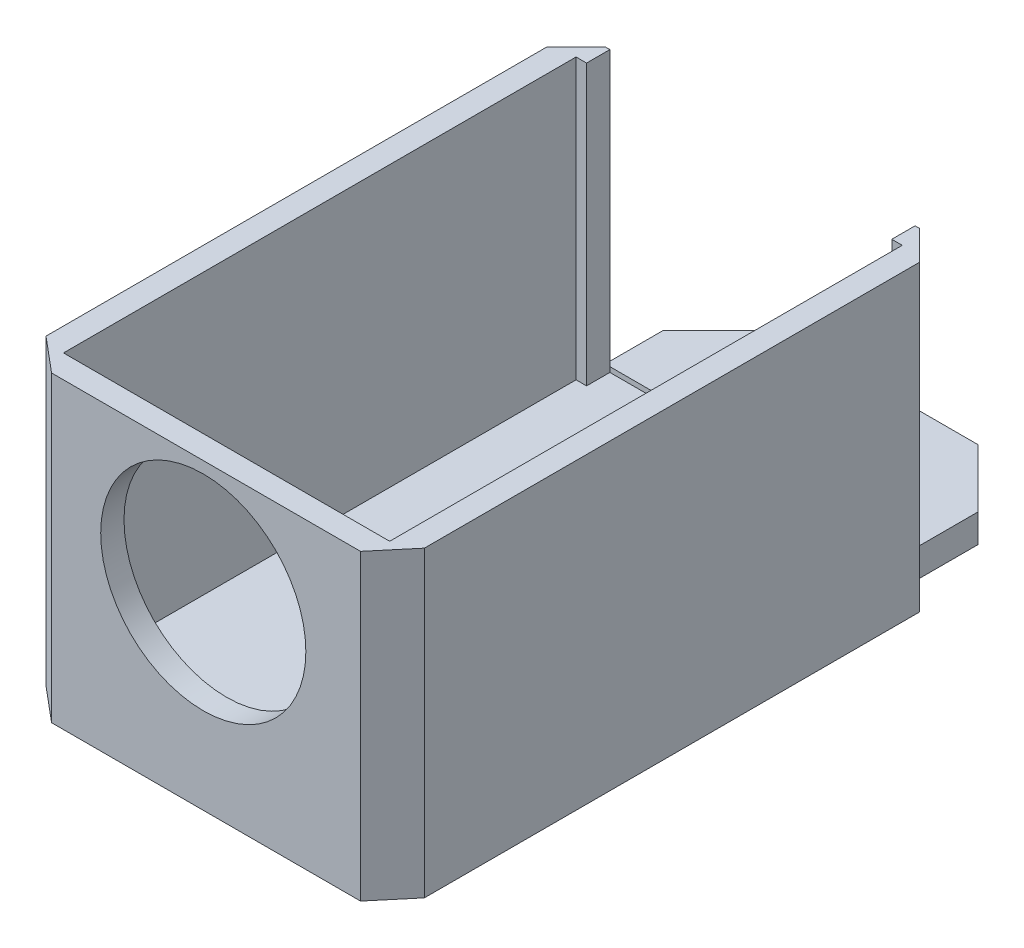
ISO-10303-21;
HEADER;
FILE_DESCRIPTION(('STEP AP214'),'2;1');
FILE_NAME('part.step','',(''),(''),'','','');
FILE_SCHEMA(('AUTOMOTIVE_DESIGN { 1 0 10303 214 1 1 1 1 }'));
ENDSEC;
DATA;
#1=APPLICATION_CONTEXT('core data for automotive mechanical design processes');
#2=APPLICATION_PROTOCOL_DEFINITION('international standard','automotive_design',2000,#1);
#3=PRODUCT_CONTEXT('',#1,'mechanical');
#4=PRODUCT('Part','Part','',(#3));
#5=PRODUCT_RELATED_PRODUCT_CATEGORY('part','',(#4));
#6=PRODUCT_DEFINITION_FORMATION('','',#4);
#7=PRODUCT_DEFINITION_CONTEXT('part definition',#1,'design');
#8=PRODUCT_DEFINITION('design','',#6,#7);
#9=PRODUCT_DEFINITION_SHAPE('','',#8);
#10=(LENGTH_UNIT() NAMED_UNIT(*) SI_UNIT(.MILLI.,.METRE.));
#11=(NAMED_UNIT(*) PLANE_ANGLE_UNIT() SI_UNIT($,.RADIAN.));
#12=(NAMED_UNIT(*) SI_UNIT($,.STERADIAN.) SOLID_ANGLE_UNIT());
#13=UNCERTAINTY_MEASURE_WITH_UNIT(LENGTH_MEASURE(1.E-05),#10,'distance_accuracy_value','');
#14=(GEOMETRIC_REPRESENTATION_CONTEXT(3) GLOBAL_UNCERTAINTY_ASSIGNED_CONTEXT((#13)) GLOBAL_UNIT_ASSIGNED_CONTEXT((#10,
#11,#12)) REPRESENTATION_CONTEXT('',''));
#15=CARTESIAN_POINT('',(0.,0.,0.));
#16=DIRECTION('',(0.,0.,1.));
#17=DIRECTION('',(1.,0.,0.));
#18=AXIS2_PLACEMENT_3D('',#15,#16,#17);
#19=CARTESIAN_POINT('',(-16.,26.,-24.));
#20=DIRECTION('',(0.,0.,1.));
#21=DIRECTION('',(1.,0.,0.));
#22=AXIS2_PLACEMENT_3D('',#19,#20,#21);
#23=PLANE('',#22);
#24=DIRECTION('',(1.,0.,0.));
#25=VECTOR('',#24,1.);
#26=CARTESIAN_POINT('',(-13.5,2.43238929317332,-24.));
#27=LINE('',#26,#25);
#28=CARTESIAN_POINT('',(-13.5,2.43238929317332,-24.));
#29=VERTEX_POINT('',#28);
#30=CARTESIAN_POINT('',(-13.1,2.43238929317332,-24.));
#31=VERTEX_POINT('',#30);
#32=EDGE_CURVE('E228',#29,#31,#27,.T.);
#33=ORIENTED_EDGE('',*,*,#32,.F.);
#34=DIRECTION('',(0.,1.,0.));
#35=VECTOR('',#34,1.);
#36=CARTESIAN_POINT('',(-13.5,26.,-24.));
#37=LINE('',#36,#35);
#38=CARTESIAN_POINT('',(-13.5,26.,-24.));
#39=VERTEX_POINT('',#38);
#40=EDGE_CURVE('E211',#29,#39,#37,.T.);
#41=ORIENTED_EDGE('',*,*,#40,.T.);
#42=DIRECTION('',(-1.,0.,0.));
#43=VECTOR('',#42,1.);
#44=CARTESIAN_POINT('',(-16.,26.,-24.));
#45=LINE('',#44,#43);
#46=CARTESIAN_POINT('',(-13.1,26.,-24.));
#47=VERTEX_POINT('',#46);
#48=EDGE_CURVE('E289',#47,#39,#45,.T.);
#49=ORIENTED_EDGE('',*,*,#48,.F.);
#50=DIRECTION('',(0.,1.,0.));
#51=VECTOR('',#50,1.);
#52=CARTESIAN_POINT('',(-13.1,2.,-24.));
#53=LINE('',#52,#51);
#54=EDGE_CURVE('E511',#31,#47,#53,.T.);
#55=ORIENTED_EDGE('',*,*,#54,.F.);
#56=EDGE_LOOP('',(#33,#41,#49,#55));
#57=FACE_BOUND('',#56,.T.);
#58=ADVANCED_FACE('F37',(#57),#23,.F.);
#59=CARTESIAN_POINT('',(13.1,2.43238929317332,-24.));
#60=VERTEX_POINT('',#59);
#61=CARTESIAN_POINT('',(13.5,2.43238929317332,-24.));
#62=VERTEX_POINT('',#61);
#63=EDGE_CURVE('E206',#60,#62,#27,.T.);
#64=ORIENTED_EDGE('',*,*,#63,.F.);
#65=DIRECTION('',(0.,-1.,0.));
#66=VECTOR('',#65,1.);
#67=CARTESIAN_POINT('',(13.1,2.,-24.));
#68=LINE('',#67,#66);
#69=CARTESIAN_POINT('',(13.1,26.,-24.));
#70=VERTEX_POINT('',#69);
#71=EDGE_CURVE('E462',#70,#60,#68,.T.);
#72=ORIENTED_EDGE('',*,*,#71,.F.);
#73=CARTESIAN_POINT('',(13.5,26.,-24.));
#74=VERTEX_POINT('',#73);
#75=EDGE_CURVE('E208',#74,#70,#45,.T.);
#76=ORIENTED_EDGE('',*,*,#75,.F.);
#77=DIRECTION('',(0.,-1.,0.));
#78=VECTOR('',#77,1.);
#79=CARTESIAN_POINT('',(13.5,26.,-24.));
#80=LINE('',#79,#78);
#81=EDGE_CURVE('E203',#74,#62,#80,.T.);
#82=ORIENTED_EDGE('',*,*,#81,.T.);
#83=EDGE_LOOP('',(#64,#72,#76,#82));
#84=FACE_BOUND('',#83,.T.);
#85=ADVANCED_FACE('F204',(#84),#23,.F.);
#86=CARTESIAN_POINT('',(-16.,26.,-22.));
#87=DIRECTION('',(0.,0.,1.));
#88=DIRECTION('',(1.,0.,0.));
#89=AXIS2_PLACEMENT_3D('',#86,#87,#88);
#90=PLANE('',#89);
#91=DIRECTION('',(0.,-1.,0.));
#92=VECTOR('',#91,1.);
#93=CARTESIAN_POINT('',(-13.1,26.,-22.));
#94=LINE('',#93,#92);
#95=CARTESIAN_POINT('',(-13.1,26.,-22.));
#96=VERTEX_POINT('',#95);
#97=CARTESIAN_POINT('',(-13.1,2.,-22.));
#98=VERTEX_POINT('',#97);
#99=EDGE_CURVE('E485',#96,#98,#94,.T.);
#100=ORIENTED_EDGE('',*,*,#99,.F.);
#101=DIRECTION('',(-1.,0.,0.));
#102=VECTOR('',#101,1.);
#103=CARTESIAN_POINT('',(-16.,26.,-22.));
#104=LINE('',#103,#102);
#105=CARTESIAN_POINT('',(-14.,26.,-22.));
#106=VERTEX_POINT('',#105);
#107=EDGE_CURVE('E273',#96,#106,#104,.T.);
#108=ORIENTED_EDGE('',*,*,#107,.T.);
#109=DIRECTION('',(0.,-1.,0.));
#110=VECTOR('',#109,1.);
#111=CARTESIAN_POINT('',(-14.,26.,-22.));
#112=LINE('',#111,#110);
#113=CARTESIAN_POINT('',(-14.,2.,-22.));
#114=VERTEX_POINT('',#113);
#115=EDGE_CURVE('E492',#106,#114,#112,.T.);
#116=ORIENTED_EDGE('',*,*,#115,.T.);
#117=DIRECTION('',(-1.,0.,0.));
#118=VECTOR('',#117,1.);
#119=CARTESIAN_POINT('',(-16.,2.,-22.));
#120=LINE('',#119,#118);
#121=EDGE_CURVE('E489',#98,#114,#120,.T.);
#122=ORIENTED_EDGE('',*,*,#121,.F.);
#123=EDGE_LOOP('',(#100,#108,#116,#122));
#124=FACE_BOUND('',#123,.T.);
#125=ADVANCED_FACE('F365',(#124),#90,.T.);
#126=CARTESIAN_POINT('',(16.,26.,-24.));
#127=DIRECTION('',(-1.,0.,0.));
#128=DIRECTION('',(0.,0.,1.));
#129=AXIS2_PLACEMENT_3D('',#126,#127,#128);
#130=PLANE('',#129);
#131=DIRECTION('',(0.,0.,-1.));
#132=VECTOR('',#131,1.);
#133=CARTESIAN_POINT('',(16.,0.,-24.));
#134=LINE('',#133,#132);
#135=CARTESIAN_POINT('',(16.,0.,21.0206160185145));
#136=VERTEX_POINT('',#135);
#137=CARTESIAN_POINT('',(16.,0.,-21.5));
#138=VERTEX_POINT('',#137);
#139=EDGE_CURVE('E298',#136,#138,#134,.T.);
#140=ORIENTED_EDGE('',*,*,#139,.T.);
#141=DIRECTION('',(0.,1.,0.));
#142=VECTOR('',#141,1.);
#143=CARTESIAN_POINT('',(16.,26.,-21.5));
#144=LINE('',#143,#142);
#145=CARTESIAN_POINT('',(16.,26.,-21.5));
#146=VERTEX_POINT('',#145);
#147=EDGE_CURVE('E226',#138,#146,#144,.T.);
#148=ORIENTED_EDGE('',*,*,#147,.T.);
#149=DIRECTION('',(0.,0.,-1.));
#150=VECTOR('',#149,1.);
#151=CARTESIAN_POINT('',(16.,26.,-24.));
#152=LINE('',#151,#150);
#153=CARTESIAN_POINT('',(16.,26.,21.0206160185145));
#154=VERTEX_POINT('',#153);
#155=EDGE_CURVE('E286',#154,#146,#152,.T.);
#156=ORIENTED_EDGE('',*,*,#155,.F.);
#157=DIRECTION('',(0.,-1.,0.));
#158=VECTOR('',#157,1.);
#159=CARTESIAN_POINT('',(16.,26.,21.0206160185145));
#160=LINE('',#159,#158);
#161=EDGE_CURVE('E297',#154,#136,#160,.T.);
#162=ORIENTED_EDGE('',*,*,#161,.T.);
#163=EDGE_LOOP('',(#140,#148,#156,#162));
#164=FACE_BOUND('',#163,.T.);
#165=ADVANCED_FACE('F370',(#164),#130,.F.);
#166=CARTESIAN_POINT('',(-16.,26.,-24.));
#167=DIRECTION('',(1.,0.,0.));
#168=DIRECTION('',(0.,0.,-1.));
#169=AXIS2_PLACEMENT_3D('',#166,#167,#168);
#170=PLANE('',#169);
#171=DIRECTION('',(0.,0.,1.));
#172=VECTOR('',#171,1.);
#173=CARTESIAN_POINT('',(-16.,26.,-24.));
#174=LINE('',#173,#172);
#175=CARTESIAN_POINT('',(-16.,26.,-21.5));
#176=VERTEX_POINT('',#175);
#177=CARTESIAN_POINT('',(-16.,26.,21.5));
#178=VERTEX_POINT('',#177);
#179=EDGE_CURVE('E292',#176,#178,#174,.T.);
#180=ORIENTED_EDGE('',*,*,#179,.F.);
#181=DIRECTION('',(0.,-1.,0.));
#182=VECTOR('',#181,1.);
#183=CARTESIAN_POINT('',(-16.,26.,-21.5));
#184=LINE('',#183,#182);
#185=CARTESIAN_POINT('',(-16.,0.,-21.5));
#186=VERTEX_POINT('',#185);
#187=EDGE_CURVE('E325',#176,#186,#184,.T.);
#188=ORIENTED_EDGE('',*,*,#187,.T.);
#189=DIRECTION('',(0.,0.,1.));
#190=VECTOR('',#189,1.);
#191=CARTESIAN_POINT('',(-16.,0.,-24.));
#192=LINE('',#191,#190);
#193=CARTESIAN_POINT('',(-16.,0.,21.5));
#194=VERTEX_POINT('',#193);
#195=EDGE_CURVE('E301',#186,#194,#192,.T.);
#196=ORIENTED_EDGE('',*,*,#195,.T.);
#197=DIRECTION('',(0.,1.,0.));
#198=VECTOR('',#197,1.);
#199=CARTESIAN_POINT('',(-16.,26.,21.5));
#200=LINE('',#199,#198);
#201=EDGE_CURVE('E322',#194,#178,#200,.T.);
#202=ORIENTED_EDGE('',*,*,#201,.T.);
#203=EDGE_LOOP('',(#180,#188,#196,#202));
#204=FACE_BOUND('',#203,.T.);
#205=ADVANCED_FACE('F368',(#204),#170,.F.);
#206=CARTESIAN_POINT('',(-16.,26.,24.));
#207=DIRECTION('',(0.,0.,-1.));
#208=DIRECTION('',(-1.,0.,0.));
#209=AXIS2_PLACEMENT_3D('',#206,#207,#208);
#210=PLANE('',#209);
#211=CARTESIAN_POINT('',(0.,16.205,24.));
#212=DIRECTION('',(0.,0.,1.));
#213=DIRECTION('',(1.,0.,0.));
#214=AXIS2_PLACEMENT_3D('',#211,#212,#213);
#215=CIRCLE('',#214,8.805);
#216=CARTESIAN_POINT('',(8.805,16.205,24.));
#217=VERTEX_POINT('',#216);
#218=EDGE_CURVE('E244',#217,#217,#215,.T.);
#219=ORIENTED_EDGE('',*,*,#218,.F.);
#220=EDGE_LOOP('',(#219));
#221=FACE_BOUND('',#220,.T.);
#222=DIRECTION('',(1.,0.,0.));
#223=VECTOR('',#222,1.);
#224=CARTESIAN_POINT('',(-16.,0.,24.));
#225=LINE('',#224,#223);
#226=CARTESIAN_POINT('',(-13.0206160185145,0.,24.));
#227=VERTEX_POINT('',#226);
#228=CARTESIAN_POINT('',(13.5,0.,24.));
#229=VERTEX_POINT('',#228);
#230=EDGE_CURVE('E290',#227,#229,#225,.T.);
#231=ORIENTED_EDGE('',*,*,#230,.T.);
#232=DIRECTION('',(0.,1.,0.));
#233=VECTOR('',#232,1.);
#234=CARTESIAN_POINT('',(13.5,26.,24.));
#235=LINE('',#234,#233);
#236=CARTESIAN_POINT('',(13.5,26.,24.));
#237=VERTEX_POINT('',#236);
#238=EDGE_CURVE('E316',#229,#237,#235,.T.);
#239=ORIENTED_EDGE('',*,*,#238,.T.);
#240=DIRECTION('',(1.,0.,0.));
#241=VECTOR('',#240,1.);
#242=CARTESIAN_POINT('',(-16.,26.,24.));
#243=LINE('',#242,#241);
#244=CARTESIAN_POINT('',(-13.0206160185145,26.,24.));
#245=VERTEX_POINT('',#244);
#246=EDGE_CURVE('E294',#245,#237,#243,.T.);
#247=ORIENTED_EDGE('',*,*,#246,.F.);
#248=DIRECTION('',(0.,-1.,0.));
#249=VECTOR('',#248,1.);
#250=CARTESIAN_POINT('',(-13.0206160185145,26.,24.));
#251=LINE('',#250,#249);
#252=EDGE_CURVE('E313',#245,#227,#251,.T.);
#253=ORIENTED_EDGE('',*,*,#252,.T.);
#254=EDGE_LOOP('',(#231,#239,#247,#253));
#255=FACE_BOUND('',#254,.T.);
#256=ADVANCED_FACE('F439',(#221,#255),#210,.F.);
#257=CARTESIAN_POINT('',(0.,26.,0.));
#258=DIRECTION('',(0.,1.,0.));
#259=DIRECTION('',(0.,0.,1.));
#260=AXIS2_PLACEMENT_3D('',#257,#258,#259);
#261=PLANE('',#260);
#262=ORIENTED_EDGE('',*,*,#48,.T.);
#263=DIRECTION('',(0.707106781186549,0.,-0.707106781186546));
#264=VECTOR('',#263,1.);
#265=CARTESIAN_POINT('',(-18.75,26.,-18.7500000000001));
#266=LINE('',#265,#264);
#267=EDGE_CURVE('E232',#39,#176,#266,.F.);
#268=ORIENTED_EDGE('',*,*,#267,.T.);
#269=ORIENTED_EDGE('',*,*,#179,.T.);
#270=DIRECTION('',(-0.766044443118976,0.,-0.642787609686542));
#271=VECTOR('',#270,1.);
#272=CARTESIAN_POINT('',(-17.1974979235459,26.,20.4951799340171));
#273=LINE('',#272,#271);
#274=EDGE_CURVE('E318',#178,#245,#273,.F.);
#275=ORIENTED_EDGE('',*,*,#274,.T.);
#276=ORIENTED_EDGE('',*,*,#246,.T.);
#277=DIRECTION('',(-0.64278760968654,0.,0.766044443118978));
#278=VECTOR('',#277,1.);
#279=CARTESIAN_POINT('',(19.7398182353983,26.,16.5636742008292));
#280=LINE('',#279,#278);
#281=EDGE_CURVE('E320',#237,#154,#280,.F.);
#282=ORIENTED_EDGE('',*,*,#281,.T.);
#283=ORIENTED_EDGE('',*,*,#155,.T.);
#284=DIRECTION('',(0.707106781186547,0.,0.707106781186549));
#285=VECTOR('',#284,1.);
#286=CARTESIAN_POINT('',(18.75,26.,-18.75));
#287=LINE('',#286,#285);
#288=EDGE_CURVE('E334',#146,#74,#287,.F.);
#289=ORIENTED_EDGE('',*,*,#288,.T.);
#290=ORIENTED_EDGE('',*,*,#75,.T.);
#291=DIRECTION('',(0.,0.,-1.));
#292=VECTOR('',#291,1.);
#293=CARTESIAN_POINT('',(13.1,26.,-4.));
#294=LINE('',#293,#292);
#295=CARTESIAN_POINT('',(13.1,26.,-22.));
#296=VERTEX_POINT('',#295);
#297=EDGE_CURVE('E461',#296,#70,#294,.T.);
#298=ORIENTED_EDGE('',*,*,#297,.F.);
#299=CARTESIAN_POINT('',(14.,26.,-22.));
#300=VERTEX_POINT('',#299);
#301=EDGE_CURVE('E279',#300,#296,#104,.T.);
#302=ORIENTED_EDGE('',*,*,#301,.F.);
#303=DIRECTION('',(0.,0.,-1.));
#304=VECTOR('',#303,1.);
#305=CARTESIAN_POINT('',(14.,26.,-24.));
#306=LINE('',#305,#304);
#307=CARTESIAN_POINT('',(14.,26.,22.));
#308=VERTEX_POINT('',#307);
#309=EDGE_CURVE('E270',#308,#300,#306,.T.);
#310=ORIENTED_EDGE('',*,*,#309,.F.);
#311=DIRECTION('',(1.,0.,0.));
#312=VECTOR('',#311,1.);
#313=CARTESIAN_POINT('',(-16.,26.,22.));
#314=LINE('',#313,#312);
#315=CARTESIAN_POINT('',(-14.,26.,22.));
#316=VERTEX_POINT('',#315);
#317=EDGE_CURVE('E284',#316,#308,#314,.T.);
#318=ORIENTED_EDGE('',*,*,#317,.F.);
#319=DIRECTION('',(0.,0.,1.));
#320=VECTOR('',#319,1.);
#321=CARTESIAN_POINT('',(-14.,26.,-24.));
#322=LINE('',#321,#320);
#323=EDGE_CURVE('E282',#106,#316,#322,.T.);
#324=ORIENTED_EDGE('',*,*,#323,.F.);
#325=ORIENTED_EDGE('',*,*,#107,.F.);
#326=DIRECTION('',(0.,0.,-1.));
#327=VECTOR('',#326,1.);
#328=CARTESIAN_POINT('',(-13.1,26.,-4.));
#329=LINE('',#328,#327);
#330=EDGE_CURVE('E467',#96,#47,#329,.T.);
#331=ORIENTED_EDGE('',*,*,#330,.T.);
#332=EDGE_LOOP('',(#262,#268,#269,#275,#276,#282,#283,#289,#290,#298,#302,#310,#318,#324,#325,#331));
#333=FACE_BOUND('',#332,.T.);
#334=ADVANCED_FACE('F436',(#333),#261,.T.);
#335=CARTESIAN_POINT('',(0.,0.,0.));
#336=DIRECTION('',(0.,1.,0.));
#337=DIRECTION('',(0.,0.,1.));
#338=AXIS2_PLACEMENT_3D('',#335,#336,#337);
#339=PLANE('',#338);
#340=DIRECTION('',(0.,0.,1.));
#341=VECTOR('',#340,1.);
#342=CARTESIAN_POINT('',(-13.5,0.,-34.));
#343=LINE('',#342,#341);
#344=CARTESIAN_POINT('',(-13.5,0.,-29.));
#345=VERTEX_POINT('',#344);
#346=CARTESIAN_POINT('',(-13.5,0.,-24.));
#347=VERTEX_POINT('',#346);
#348=EDGE_CURVE('E346',#345,#347,#343,.T.);
#349=ORIENTED_EDGE('',*,*,#348,.F.);
#350=DIRECTION('',(0.707106781186546,0.,-0.707106781186549));
#351=VECTOR('',#350,1.);
#352=CARTESIAN_POINT('',(-8.49999999999997,0.,-34.));
#353=LINE('',#352,#351);
#354=CARTESIAN_POINT('',(-8.49999999999997,0.,-34.));
#355=VERTEX_POINT('',#354);
#356=EDGE_CURVE('E47',#345,#355,#353,.T.);
#357=ORIENTED_EDGE('',*,*,#356,.T.);
#358=DIRECTION('',(-1.,0.,0.));
#359=VECTOR('',#358,1.);
#360=CARTESIAN_POINT('',(13.5,0.,-34.));
#361=LINE('',#360,#359);
#362=CARTESIAN_POINT('',(8.50000000000001,0.,-34.));
#363=VERTEX_POINT('',#362);
#364=EDGE_CURVE('E234',#363,#355,#361,.T.);
#365=ORIENTED_EDGE('',*,*,#364,.F.);
#366=DIRECTION('',(0.707106781186546,0.,0.707106781186549));
#367=VECTOR('',#366,1.);
#368=CARTESIAN_POINT('',(8.50000000000001,0.,-34.));
#369=LINE('',#368,#367);
#370=CARTESIAN_POINT('',(13.5,0.,-29.));
#371=VERTEX_POINT('',#370);
#372=EDGE_CURVE('E54',#363,#371,#369,.T.);
#373=ORIENTED_EDGE('',*,*,#372,.T.);
#374=DIRECTION('',(0.,0.,1.));
#375=VECTOR('',#374,1.);
#376=CARTESIAN_POINT('',(13.5,0.,-34.));
#377=LINE('',#376,#375);
#378=CARTESIAN_POINT('',(13.5,0.,-24.));
#379=VERTEX_POINT('',#378);
#380=EDGE_CURVE('E512',#371,#379,#377,.T.);
#381=ORIENTED_EDGE('',*,*,#380,.T.);
#382=DIRECTION('',(-0.707106781186547,0.,-0.707106781186549));
#383=VECTOR('',#382,1.);
#384=CARTESIAN_POINT('',(13.5,0.,-24.));
#385=LINE('',#384,#383);
#386=EDGE_CURVE('E217',#379,#138,#385,.F.);
#387=ORIENTED_EDGE('',*,*,#386,.T.);
#388=ORIENTED_EDGE('',*,*,#139,.F.);
#389=DIRECTION('',(0.64278760968654,0.,-0.766044443118978));
#390=VECTOR('',#389,1.);
#391=CARTESIAN_POINT('',(16.,0.,21.0206160185145));
#392=LINE('',#391,#390);
#393=EDGE_CURVE('E311',#136,#229,#392,.F.);
#394=ORIENTED_EDGE('',*,*,#393,.T.);
#395=ORIENTED_EDGE('',*,*,#230,.F.);
#396=DIRECTION('',(0.766044443118976,0.,0.642787609686542));
#397=VECTOR('',#396,1.);
#398=CARTESIAN_POINT('',(-13.0206160185145,0.,24.));
#399=LINE('',#398,#397);
#400=EDGE_CURVE('E308',#227,#194,#399,.F.);
#401=ORIENTED_EDGE('',*,*,#400,.T.);
#402=ORIENTED_EDGE('',*,*,#195,.F.);
#403=DIRECTION('',(-0.707106781186549,0.,0.707106781186546));
#404=VECTOR('',#403,1.);
#405=CARTESIAN_POINT('',(-16.,0.,-21.5));
#406=LINE('',#405,#404);
#407=EDGE_CURVE('E212',#186,#347,#406,.F.);
#408=ORIENTED_EDGE('',*,*,#407,.T.);
#409=EDGE_LOOP('',(#349,#357,#365,#373,#381,#387,#388,#394,#395,#401,#402,#408));
#410=FACE_BOUND('',#409,.T.);
#411=ADVANCED_FACE('F345',(#410),#339,.F.);
#412=CARTESIAN_POINT('',(14.,26.,-24.));
#413=DIRECTION('',(-1.,0.,0.));
#414=DIRECTION('',(0.,0.,1.));
#415=AXIS2_PLACEMENT_3D('',#412,#413,#414);
#416=PLANE('',#415);
#417=DIRECTION('',(0.,0.,-1.));
#418=VECTOR('',#417,1.);
#419=CARTESIAN_POINT('',(14.,2.,-24.));
#420=LINE('',#419,#418);
#421=CARTESIAN_POINT('',(14.,2.,22.));
#422=VERTEX_POINT('',#421);
#423=CARTESIAN_POINT('',(14.,2.,-22.));
#424=VERTEX_POINT('',#423);
#425=EDGE_CURVE('E487',#422,#424,#420,.T.);
#426=ORIENTED_EDGE('',*,*,#425,.F.);
#427=DIRECTION('',(0.,-1.,0.));
#428=VECTOR('',#427,1.);
#429=CARTESIAN_POINT('',(14.,26.,22.));
#430=LINE('',#429,#428);
#431=EDGE_CURVE('E266',#308,#422,#430,.T.);
#432=ORIENTED_EDGE('',*,*,#431,.F.);
#433=ORIENTED_EDGE('',*,*,#309,.T.);
#434=DIRECTION('',(0.,-1.,0.));
#435=VECTOR('',#434,1.);
#436=CARTESIAN_POINT('',(14.,26.,-22.));
#437=LINE('',#436,#435);
#438=EDGE_CURVE('E302',#300,#424,#437,.T.);
#439=ORIENTED_EDGE('',*,*,#438,.T.);
#440=EDGE_LOOP('',(#426,#432,#433,#439));
#441=FACE_BOUND('',#440,.T.);
#442=ADVANCED_FACE('F423',(#441),#416,.T.);
#443=DIRECTION('',(0.,1.,0.));
#444=VECTOR('',#443,1.);
#445=CARTESIAN_POINT('',(13.1,26.,-22.));
#446=LINE('',#445,#444);
#447=CARTESIAN_POINT('',(13.1,2.,-22.));
#448=VERTEX_POINT('',#447);
#449=EDGE_CURVE('E465',#448,#296,#446,.T.);
#450=ORIENTED_EDGE('',*,*,#449,.F.);
#451=EDGE_CURVE('E275',#424,#448,#120,.T.);
#452=ORIENTED_EDGE('',*,*,#451,.F.);
#453=ORIENTED_EDGE('',*,*,#438,.F.);
#454=ORIENTED_EDGE('',*,*,#301,.T.);
#455=EDGE_LOOP('',(#450,#452,#453,#454));
#456=FACE_BOUND('',#455,.T.);
#457=ADVANCED_FACE('F426',(#456),#90,.T.);
#458=CARTESIAN_POINT('',(-14.,26.,-24.));
#459=DIRECTION('',(1.,0.,0.));
#460=DIRECTION('',(0.,0.,-1.));
#461=AXIS2_PLACEMENT_3D('',#458,#459,#460);
#462=PLANE('',#461);
#463=DIRECTION('',(0.,0.,1.));
#464=VECTOR('',#463,1.);
#465=CARTESIAN_POINT('',(-14.,2.,-24.));
#466=LINE('',#465,#464);
#467=CARTESIAN_POINT('',(-14.,2.,22.));
#468=VERTEX_POINT('',#467);
#469=EDGE_CURVE('E271',#114,#468,#466,.T.);
#470=ORIENTED_EDGE('',*,*,#469,.F.);
#471=ORIENTED_EDGE('',*,*,#115,.F.);
#472=ORIENTED_EDGE('',*,*,#323,.T.);
#473=DIRECTION('',(0.,-1.,0.));
#474=VECTOR('',#473,1.);
#475=CARTESIAN_POINT('',(-14.,26.,22.));
#476=LINE('',#475,#474);
#477=EDGE_CURVE('E263',#316,#468,#476,.T.);
#478=ORIENTED_EDGE('',*,*,#477,.T.);
#479=EDGE_LOOP('',(#470,#471,#472,#478));
#480=FACE_BOUND('',#479,.T.);
#481=ADVANCED_FACE('F257',(#480),#462,.T.);
#482=CARTESIAN_POINT('',(-16.,26.,22.));
#483=DIRECTION('',(0.,0.,-1.));
#484=DIRECTION('',(-1.,0.,0.));
#485=AXIS2_PLACEMENT_3D('',#482,#483,#484);
#486=PLANE('',#485);
#487=CARTESIAN_POINT('',(0.,16.205,22.));
#488=DIRECTION('',(0.,0.,-1.));
#489=DIRECTION('',(-1.,0.,0.));
#490=AXIS2_PLACEMENT_3D('',#487,#488,#489);
#491=CIRCLE('',#490,8.805);
#492=CARTESIAN_POINT('',(-8.805,16.205,22.));
#493=VERTEX_POINT('',#492);
#494=EDGE_CURVE('E42',#493,#493,#491,.T.);
#495=ORIENTED_EDGE('',*,*,#494,.F.);
#496=EDGE_LOOP('',(#495));
#497=FACE_BOUND('',#496,.T.);
#498=DIRECTION('',(1.,0.,0.));
#499=VECTOR('',#498,1.);
#500=CARTESIAN_POINT('',(-16.,2.,22.));
#501=LINE('',#500,#499);
#502=EDGE_CURVE('E261',#468,#422,#501,.T.);
#503=ORIENTED_EDGE('',*,*,#502,.F.);
#504=ORIENTED_EDGE('',*,*,#477,.F.);
#505=ORIENTED_EDGE('',*,*,#317,.T.);
#506=ORIENTED_EDGE('',*,*,#431,.T.);
#507=EDGE_LOOP('',(#503,#504,#505,#506));
#508=FACE_BOUND('',#507,.T.);
#509=ADVANCED_FACE('F253',(#497,#508),#486,.T.);
#510=CARTESIAN_POINT('',(0.,2.,0.));
#511=DIRECTION('',(0.,1.,0.));
#512=DIRECTION('',(0.,0.,1.));
#513=AXIS2_PLACEMENT_3D('',#510,#511,#512);
#514=PLANE('',#513);
#515=ORIENTED_EDGE('',*,*,#451,.T.);
#516=DIRECTION('',(0.,0.,-1.));
#517=VECTOR('',#516,1.);
#518=CARTESIAN_POINT('',(13.1,2.,-4.));
#519=LINE('',#518,#517);
#520=CARTESIAN_POINT('',(13.1,2.,-24.));
#521=VERTEX_POINT('',#520);
#522=EDGE_CURVE('E466',#448,#521,#519,.T.);
#523=ORIENTED_EDGE('',*,*,#522,.T.);
#524=DIRECTION('',(-1.,0.,0.));
#525=VECTOR('',#524,1.);
#526=CARTESIAN_POINT('',(13.1,2.,-24.));
#527=LINE('',#526,#525);
#528=CARTESIAN_POINT('',(-13.1,2.,-24.));
#529=VERTEX_POINT('',#528);
#530=EDGE_CURVE('E469',#521,#529,#527,.T.);
#531=ORIENTED_EDGE('',*,*,#530,.T.);
#532=DIRECTION('',(0.,0.,-1.));
#533=VECTOR('',#532,1.);
#534=CARTESIAN_POINT('',(-13.1,2.,-4.));
#535=LINE('',#534,#533);
#536=EDGE_CURVE('E478',#98,#529,#535,.T.);
#537=ORIENTED_EDGE('',*,*,#536,.F.);
#538=ORIENTED_EDGE('',*,*,#121,.T.);
#539=ORIENTED_EDGE('',*,*,#469,.T.);
#540=ORIENTED_EDGE('',*,*,#502,.T.);
#541=ORIENTED_EDGE('',*,*,#425,.T.);
#542=EDGE_LOOP('',(#515,#523,#531,#537,#538,#539,#540,#541));
#543=FACE_BOUND('',#542,.T.);
#544=ADVANCED_FACE('F256',(#543),#514,.T.);
#545=CARTESIAN_POINT('',(-13.1,2.,-4.));
#546=DIRECTION('',(-1.,0.,0.));
#547=DIRECTION('',(0.,0.,1.));
#548=AXIS2_PLACEMENT_3D('',#545,#546,#547);
#549=PLANE('',#548);
#550=ORIENTED_EDGE('',*,*,#99,.T.);
#551=ORIENTED_EDGE('',*,*,#536,.T.);
#552=EDGE_CURVE('E474',#529,#31,#53,.T.);
#553=ORIENTED_EDGE('',*,*,#552,.T.);
#554=ORIENTED_EDGE('',*,*,#54,.T.);
#555=ORIENTED_EDGE('',*,*,#330,.F.);
#556=EDGE_LOOP('',(#550,#551,#553,#554,#555));
#557=FACE_BOUND('',#556,.T.);
#558=ADVANCED_FACE('F418',(#557),#549,.F.);
#559=CARTESIAN_POINT('',(13.1,2.,-4.));
#560=DIRECTION('',(1.,0.,0.));
#561=DIRECTION('',(0.,0.,-1.));
#562=AXIS2_PLACEMENT_3D('',#559,#560,#561);
#563=PLANE('',#562);
#564=ORIENTED_EDGE('',*,*,#449,.T.);
#565=ORIENTED_EDGE('',*,*,#297,.T.);
#566=ORIENTED_EDGE('',*,*,#71,.T.);
#567=EDGE_CURVE('E470',#60,#521,#68,.T.);
#568=ORIENTED_EDGE('',*,*,#567,.T.);
#569=ORIENTED_EDGE('',*,*,#522,.F.);
#570=EDGE_LOOP('',(#564,#565,#566,#568,#569));
#571=FACE_BOUND('',#570,.T.);
#572=ADVANCED_FACE('F382',(#571),#563,.F.);
#573=CARTESIAN_POINT('',(16.,26.,21.0206160185145));
#574=DIRECTION('',(-0.766044443118978,0.,-0.642787609686539));
#575=DIRECTION('',(0.,-1.,0.));
#576=AXIS2_PLACEMENT_3D('',#573,#574,#575);
#577=PLANE('',#576);
#578=ORIENTED_EDGE('',*,*,#281,.F.);
#579=ORIENTED_EDGE('',*,*,#238,.F.);
#580=ORIENTED_EDGE('',*,*,#393,.F.);
#581=ORIENTED_EDGE('',*,*,#161,.F.);
#582=EDGE_LOOP('',(#578,#579,#580,#581));
#583=FACE_BOUND('',#582,.T.);
#584=ADVANCED_FACE('F375',(#583),#577,.F.);
#585=CARTESIAN_POINT('',(-13.0206160185145,26.,24.));
#586=DIRECTION('',(0.642787609686542,0.,-0.766044443118976));
#587=DIRECTION('',(0.,-1.,0.));
#588=AXIS2_PLACEMENT_3D('',#585,#586,#587);
#589=PLANE('',#588);
#590=ORIENTED_EDGE('',*,*,#274,.F.);
#591=ORIENTED_EDGE('',*,*,#201,.F.);
#592=ORIENTED_EDGE('',*,*,#400,.F.);
#593=ORIENTED_EDGE('',*,*,#252,.F.);
#594=EDGE_LOOP('',(#590,#591,#592,#593));
#595=FACE_BOUND('',#594,.T.);
#596=ADVANCED_FACE('F381',(#595),#589,.F.);
#597=CARTESIAN_POINT('',(-16.,26.,-21.5));
#598=DIRECTION('',(0.707106781186546,0.,0.707106781186549));
#599=DIRECTION('',(0.,-1.,0.));
#600=AXIS2_PLACEMENT_3D('',#597,#598,#599);
#601=PLANE('',#600);
#602=ORIENTED_EDGE('',*,*,#267,.F.);
#603=ORIENTED_EDGE('',*,*,#40,.F.);
#604=EDGE_CURVE('E331',#347,#29,#37,.T.);
#605=ORIENTED_EDGE('',*,*,#604,.F.);
#606=ORIENTED_EDGE('',*,*,#407,.F.);
#607=ORIENTED_EDGE('',*,*,#187,.F.);
#608=EDGE_LOOP('',(#602,#603,#605,#606,#607));
#609=FACE_BOUND('',#608,.T.);
#610=ADVANCED_FACE('F389',(#609),#601,.F.);
#611=CARTESIAN_POINT('',(13.5,26.,-24.));
#612=DIRECTION('',(-0.707106781186548,0.,0.707106781186546));
#613=DIRECTION('',(0.,-1.,0.));
#614=AXIS2_PLACEMENT_3D('',#611,#612,#613);
#615=PLANE('',#614);
#616=ORIENTED_EDGE('',*,*,#288,.F.);
#617=ORIENTED_EDGE('',*,*,#147,.F.);
#618=ORIENTED_EDGE('',*,*,#386,.F.);
#619=DIRECTION('',(0.,-1.,0.));
#620=VECTOR('',#619,1.);
#621=CARTESIAN_POINT('',(13.5,2.43238929317332,-24.));
#622=LINE('',#621,#620);
#623=EDGE_CURVE('E192',#62,#379,#622,.T.);
#624=ORIENTED_EDGE('',*,*,#623,.F.);
#625=ORIENTED_EDGE('',*,*,#81,.F.);
#626=EDGE_LOOP('',(#616,#617,#618,#624,#625));
#627=FACE_BOUND('',#626,.T.);
#628=ADVANCED_FACE('F215',(#627),#615,.F.);
#629=CARTESIAN_POINT('',(13.5,2.43238929317332,-34.));
#630=DIRECTION('',(-1.,0.,0.));
#631=DIRECTION('',(0.,0.,1.));
#632=AXIS2_PLACEMENT_3D('',#629,#630,#631);
#633=PLANE('',#632);
#634=ORIENTED_EDGE('',*,*,#380,.F.);
#635=DIRECTION('',(0.,1.,0.));
#636=VECTOR('',#635,1.);
#637=CARTESIAN_POINT('',(13.5,2.43238929317332,-29.));
#638=LINE('',#637,#636);
#639=CARTESIAN_POINT('',(13.5,2.43238929317332,-29.));
#640=VERTEX_POINT('',#639);
#641=EDGE_CURVE('E11',#371,#640,#638,.T.);
#642=ORIENTED_EDGE('',*,*,#641,.T.);
#643=DIRECTION('',(0.,0.,1.));
#644=VECTOR('',#643,1.);
#645=CARTESIAN_POINT('',(13.5,2.43238929317332,-34.));
#646=LINE('',#645,#644);
#647=EDGE_CURVE('E188',#640,#62,#646,.T.);
#648=ORIENTED_EDGE('',*,*,#647,.T.);
#649=ORIENTED_EDGE('',*,*,#623,.T.);
#650=EDGE_LOOP('',(#634,#642,#648,#649));
#651=FACE_BOUND('',#650,.T.);
#652=ADVANCED_FACE('F190',(#651),#633,.F.);
#653=CARTESIAN_POINT('',(-13.5,0.,-34.));
#654=DIRECTION('',(1.,0.,0.));
#655=DIRECTION('',(0.,0.,-1.));
#656=AXIS2_PLACEMENT_3D('',#653,#654,#655);
#657=PLANE('',#656);
#658=DIRECTION('',(0.,0.,1.));
#659=VECTOR('',#658,1.);
#660=CARTESIAN_POINT('',(-13.5,2.43238929317332,-34.));
#661=LINE('',#660,#659);
#662=CARTESIAN_POINT('',(-13.5,2.43238929317332,-29.));
#663=VERTEX_POINT('',#662);
#664=EDGE_CURVE('E197',#663,#29,#661,.T.);
#665=ORIENTED_EDGE('',*,*,#664,.F.);
#666=DIRECTION('',(0.,-1.,0.));
#667=VECTOR('',#666,1.);
#668=CARTESIAN_POINT('',(-13.5,0.,-29.));
#669=LINE('',#668,#667);
#670=EDGE_CURVE('E62',#663,#345,#669,.T.);
#671=ORIENTED_EDGE('',*,*,#670,.T.);
#672=ORIENTED_EDGE('',*,*,#348,.T.);
#673=ORIENTED_EDGE('',*,*,#604,.T.);
#674=EDGE_LOOP('',(#665,#671,#672,#673));
#675=FACE_BOUND('',#674,.T.);
#676=ADVANCED_FACE('F408',(#675),#657,.F.);
#677=CARTESIAN_POINT('',(-13.5,2.43238929317332,-34.));
#678=DIRECTION('',(0.,-1.,0.));
#679=DIRECTION('',(1.,0.,0.));
#680=AXIS2_PLACEMENT_3D('',#677,#678,#679);
#681=PLANE('',#680);
#682=DIRECTION('',(1.,0.,0.));
#683=VECTOR('',#682,1.);
#684=CARTESIAN_POINT('',(-13.5,2.43238929317332,-34.));
#685=LINE('',#684,#683);
#686=CARTESIAN_POINT('',(-8.49999999999997,2.43238929317332,-34.));
#687=VERTEX_POINT('',#686);
#688=CARTESIAN_POINT('',(8.50000000000001,2.43238929317332,-34.));
#689=VERTEX_POINT('',#688);
#690=EDGE_CURVE('E198',#687,#689,#685,.T.);
#691=ORIENTED_EDGE('',*,*,#690,.F.);
#692=DIRECTION('',(-0.707106781186546,0.,0.707106781186549));
#693=VECTOR('',#692,1.);
#694=CARTESIAN_POINT('',(-8.49999999999997,2.43238929317332,-34.));
#695=LINE('',#694,#693);
#696=EDGE_CURVE('E340',#687,#663,#695,.T.);
#697=ORIENTED_EDGE('',*,*,#696,.T.);
#698=ORIENTED_EDGE('',*,*,#664,.T.);
#699=ORIENTED_EDGE('',*,*,#32,.T.);
#700=EDGE_CURVE('E218',#31,#60,#27,.T.);
#701=ORIENTED_EDGE('',*,*,#700,.T.);
#702=ORIENTED_EDGE('',*,*,#63,.T.);
#703=ORIENTED_EDGE('',*,*,#647,.F.);
#704=DIRECTION('',(-0.707106781186546,0.,-0.707106781186549));
#705=VECTOR('',#704,1.);
#706=CARTESIAN_POINT('',(8.50000000000001,2.43238929317332,-34.));
#707=LINE('',#706,#705);
#708=EDGE_CURVE('E338',#640,#689,#707,.T.);
#709=ORIENTED_EDGE('',*,*,#708,.T.);
#710=EDGE_LOOP('',(#691,#697,#698,#699,#701,#702,#703,#709));
#711=FACE_BOUND('',#710,.T.);
#712=ADVANCED_FACE('F222',(#711),#681,.F.);
#713=CARTESIAN_POINT('',(0.,0.,-34.));
#714=DIRECTION('',(0.,0.,-1.));
#715=DIRECTION('',(-1.,0.,0.));
#716=AXIS2_PLACEMENT_3D('',#713,#714,#715);
#717=PLANE('',#716);
#718=ORIENTED_EDGE('',*,*,#364,.T.);
#719=DIRECTION('',(0.,1.,0.));
#720=VECTOR('',#719,1.);
#721=CARTESIAN_POINT('',(-8.49999999999997,2.43238929317332,-34.));
#722=LINE('',#721,#720);
#723=EDGE_CURVE('E230',#355,#687,#722,.T.);
#724=ORIENTED_EDGE('',*,*,#723,.T.);
#725=ORIENTED_EDGE('',*,*,#690,.T.);
#726=DIRECTION('',(0.,-1.,0.));
#727=VECTOR('',#726,1.);
#728=CARTESIAN_POINT('',(8.50000000000001,0.,-34.));
#729=LINE('',#728,#727);
#730=EDGE_CURVE('E225',#689,#363,#729,.T.);
#731=ORIENTED_EDGE('',*,*,#730,.T.);
#732=EDGE_LOOP('',(#718,#724,#725,#731));
#733=FACE_BOUND('',#732,.T.);
#734=ADVANCED_FACE('F349',(#733),#717,.T.);
#735=CARTESIAN_POINT('',(0.,0.,-24.));
#736=DIRECTION('',(0.,0.,-1.));
#737=DIRECTION('',(-1.,0.,0.));
#738=AXIS2_PLACEMENT_3D('',#735,#736,#737);
#739=PLANE('',#738);
#740=ORIENTED_EDGE('',*,*,#552,.F.);
#741=ORIENTED_EDGE('',*,*,#530,.F.);
#742=ORIENTED_EDGE('',*,*,#567,.F.);
#743=ORIENTED_EDGE('',*,*,#700,.F.);
#744=EDGE_LOOP('',(#740,#741,#742,#743));
#745=FACE_BOUND('',#744,.T.);
#746=ADVANCED_FACE('F358',(#745),#739,.F.);
#747=CARTESIAN_POINT('',(-8.49999999999997,0.,-34.));
#748=DIRECTION('',(-0.707106781186549,0.,-0.707106781186546));
#749=DIRECTION('',(0.,-1.,0.));
#750=AXIS2_PLACEMENT_3D('',#747,#748,#749);
#751=PLANE('',#750);
#752=ORIENTED_EDGE('',*,*,#356,.F.);
#753=ORIENTED_EDGE('',*,*,#670,.F.);
#754=ORIENTED_EDGE('',*,*,#696,.F.);
#755=ORIENTED_EDGE('',*,*,#723,.F.);
#756=EDGE_LOOP('',(#752,#753,#754,#755));
#757=FACE_BOUND('',#756,.T.);
#758=ADVANCED_FACE('F348',(#757),#751,.T.);
#759=CARTESIAN_POINT('',(8.50000000000001,0.,-34.));
#760=DIRECTION('',(0.707106781186549,0.,-0.707106781186546));
#761=DIRECTION('',(0.,1.,0.));
#762=AXIS2_PLACEMENT_3D('',#759,#760,#761);
#763=PLANE('',#762);
#764=ORIENTED_EDGE('',*,*,#708,.F.);
#765=ORIENTED_EDGE('',*,*,#641,.F.);
#766=ORIENTED_EDGE('',*,*,#372,.F.);
#767=ORIENTED_EDGE('',*,*,#730,.F.);
#768=EDGE_LOOP('',(#764,#765,#766,#767));
#769=FACE_BOUND('',#768,.T.);
#770=ADVANCED_FACE('F40',(#769),#763,.T.);
#771=CARTESIAN_POINT('',(0.,16.205,14.));
#772=DIRECTION('',(0.,0.,1.));
#773=DIRECTION('',(1.,0.,0.));
#774=AXIS2_PLACEMENT_3D('',#771,#772,#773);
#775=CYLINDRICAL_SURFACE('',#774,8.805);
#776=ORIENTED_EDGE('',*,*,#494,.T.);
#777=EDGE_LOOP('',(#776));
#778=FACE_BOUND('',#777,.T.);
#779=ORIENTED_EDGE('',*,*,#218,.T.);
#780=EDGE_LOOP('',(#779));
#781=FACE_BOUND('',#780,.T.);
#782=ADVANCED_FACE('F251',(#778,#781),#775,.F.);
#783=CLOSED_SHELL('',(#58,#85,#125,#165,#205,#256,#334,#411,#442,#457,#481,#509,#544,#558,#572,
#584,#596,#610,#628,#652,#676,#712,#734,#746,#758,#770,#782));
#784=MANIFOLD_SOLID_BREP('B2',#783);
#785=ADVANCED_BREP_SHAPE_REPRESENTATION('',(#18,#784),#14);
#786=SHAPE_DEFINITION_REPRESENTATION(#9,#785);
ENDSEC;
END-ISO-10303-21;
